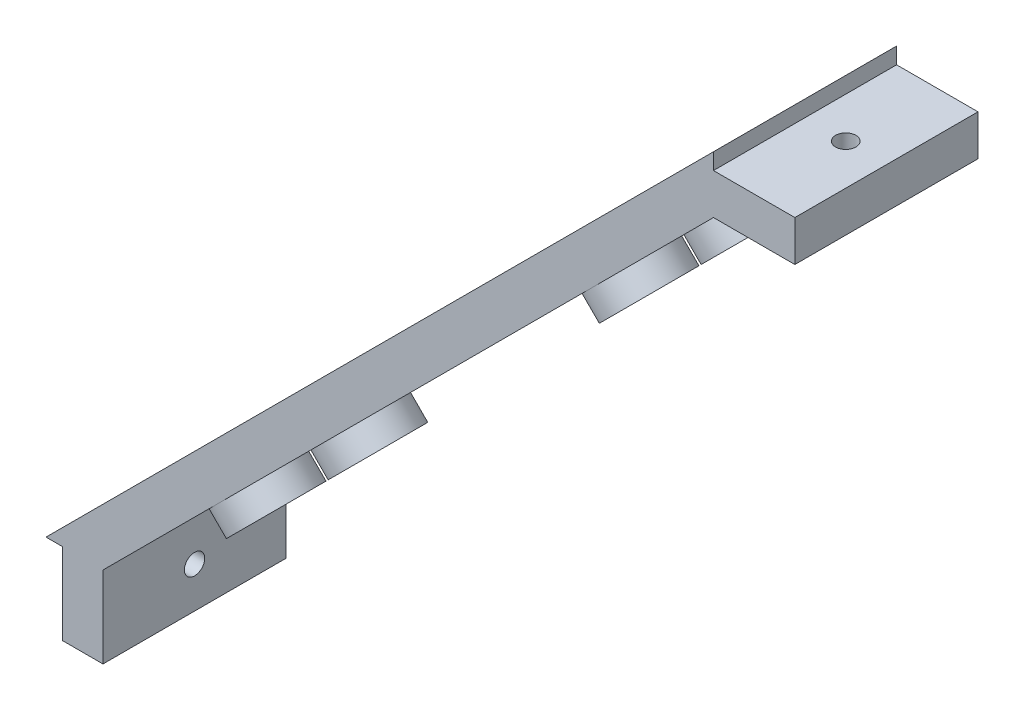
ISO-10303-21;
HEADER;
FILE_DESCRIPTION(('STEP AP214'),'2;1');
FILE_NAME('part.step','',(''),(''),'','','');
FILE_SCHEMA(('AUTOMOTIVE_DESIGN { 1 0 10303 214 1 1 1 1 }'));
ENDSEC;
DATA;
#1=APPLICATION_CONTEXT('core data for automotive mechanical design processes');
#2=APPLICATION_PROTOCOL_DEFINITION('international standard','automotive_design',2000,#1);
#3=PRODUCT_CONTEXT('',#1,'mechanical');
#4=PRODUCT('Part','Part','',(#3));
#5=PRODUCT_RELATED_PRODUCT_CATEGORY('part','',(#4));
#6=PRODUCT_DEFINITION_FORMATION('','',#4);
#7=PRODUCT_DEFINITION_CONTEXT('part definition',#1,'design');
#8=PRODUCT_DEFINITION('design','',#6,#7);
#9=PRODUCT_DEFINITION_SHAPE('','',#8);
#10=(LENGTH_UNIT() NAMED_UNIT(*) SI_UNIT(.MILLI.,.METRE.));
#11=(NAMED_UNIT(*) PLANE_ANGLE_UNIT() SI_UNIT($,.RADIAN.));
#12=(NAMED_UNIT(*) SI_UNIT($,.STERADIAN.) SOLID_ANGLE_UNIT());
#13=UNCERTAINTY_MEASURE_WITH_UNIT(LENGTH_MEASURE(1.E-05),#10,'distance_accuracy_value','');
#14=(GEOMETRIC_REPRESENTATION_CONTEXT(3) GLOBAL_UNCERTAINTY_ASSIGNED_CONTEXT((#13)) GLOBAL_UNIT_ASSIGNED_CONTEXT((#10,
#11,#12)) REPRESENTATION_CONTEXT('',''));
#15=CARTESIAN_POINT('',(0.,0.,0.));
#16=DIRECTION('',(0.,0.,1.));
#17=DIRECTION('',(1.,0.,0.));
#18=AXIS2_PLACEMENT_3D('',#15,#16,#17);
#19=CARTESIAN_POINT('',(-69.284271247462,12.715728752538,-6.25));
#20=DIRECTION('',(0.707106781186549,-0.707106781186546,0.));
#21=DIRECTION('',(0.707106781186546,0.707106781186549,0.));
#22=AXIS2_PLACEMENT_3D('',#19,#20,#21);
#23=CYLINDRICAL_SURFACE('',#22,1.25);
#24=CARTESIAN_POINT('',(-24.7842712474619,-31.7842712474619,-6.25));
#25=DIRECTION('',(-0.707106781186549,0.707106781186546,0.));
#26=DIRECTION('',(-0.707106781186546,-0.707106781186549,0.));
#27=AXIS2_PLACEMENT_3D('',#24,#25,#26);
#28=CIRCLE('',#27,1.25);
#29=CARTESIAN_POINT('',(-25.668154723945,-32.6681547239451,-6.25));
#30=VERTEX_POINT('',#29);
#31=EDGE_CURVE('E43',#30,#30,#28,.T.);
#32=ORIENTED_EDGE('',*,*,#31,.F.);
#33=EDGE_LOOP('',(#32));
#34=FACE_BOUND('',#33,.T.);
#35=CARTESIAN_POINT('',(-28.2842712474619,-28.2842712474619,-6.25));
#36=DIRECTION('',(0.707106781186549,-0.707106781186546,0.));
#37=DIRECTION('',(0.707106781186546,0.707106781186549,0.));
#38=AXIS2_PLACEMENT_3D('',#35,#36,#37);
#39=CIRCLE('',#38,1.25);
#40=CARTESIAN_POINT('',(-27.4003877709787,-27.4003877709788,-6.25));
#41=VERTEX_POINT('',#40);
#42=EDGE_CURVE('E11',#41,#41,#39,.F.);
#43=ORIENTED_EDGE('',*,*,#42,.T.);
#44=EDGE_LOOP('',(#43));
#45=FACE_BOUND('',#44,.T.);
#46=ADVANCED_FACE('F35',(#34,#45),#23,.F.);
#47=CARTESIAN_POINT('',(-55.1421356237311,26.857864376269,-6.25));
#48=DIRECTION('',(0.707106781186549,-0.707106781186546,0.));
#49=DIRECTION('',(0.707106781186546,0.707106781186549,0.));
#50=AXIS2_PLACEMENT_3D('',#47,#48,#49);
#51=CYLINDRICAL_SURFACE('',#50,1.25);
#52=CARTESIAN_POINT('',(-10.6421356237309,-17.6421356237309,-6.25));
#53=DIRECTION('',(-0.707106781186549,0.707106781186546,0.));
#54=DIRECTION('',(-0.707106781186546,-0.707106781186549,0.));
#55=AXIS2_PLACEMENT_3D('',#52,#53,#54);
#56=CIRCLE('',#55,1.25);
#57=CARTESIAN_POINT('',(-11.5260191002141,-18.5260191002141,-6.25));
#58=VERTEX_POINT('',#57);
#59=EDGE_CURVE('E171',#58,#58,#56,.T.);
#60=ORIENTED_EDGE('',*,*,#59,.F.);
#61=EDGE_LOOP('',(#60));
#62=FACE_BOUND('',#61,.T.);
#63=CARTESIAN_POINT('',(-14.1421356237309,-14.142135623731,-6.25));
#64=DIRECTION('',(0.707106781186549,-0.707106781186546,0.));
#65=DIRECTION('',(0.707106781186546,0.707106781186549,0.));
#66=AXIS2_PLACEMENT_3D('',#63,#64,#65);
#67=CIRCLE('',#66,1.25);
#68=CARTESIAN_POINT('',(-13.2582521472478,-13.2582521472478,-6.25));
#69=VERTEX_POINT('',#68);
#70=EDGE_CURVE('E174',#69,#69,#67,.F.);
#71=ORIENTED_EDGE('',*,*,#70,.T.);
#72=EDGE_LOOP('',(#71));
#73=FACE_BOUND('',#72,.T.);
#74=ADVANCED_FACE('F330',(#62,#73),#51,.F.);
#75=CARTESIAN_POINT('',(-41.0000000000001,41.,-6.25));
#76=DIRECTION('',(0.707106781186549,-0.707106781186546,0.));
#77=DIRECTION('',(0.707106781186546,0.707106781186549,0.));
#78=AXIS2_PLACEMENT_3D('',#75,#76,#77);
#79=CYLINDRICAL_SURFACE('',#78,1.25);
#80=CARTESIAN_POINT('',(3.49999999999999,-3.49999999999998,-6.25));
#81=DIRECTION('',(-0.707106781186549,0.707106781186546,0.));
#82=DIRECTION('',(-0.707106781186546,-0.707106781186549,0.));
#83=AXIS2_PLACEMENT_3D('',#80,#81,#82);
#84=CIRCLE('',#83,1.25);
#85=CARTESIAN_POINT('',(2.61611652351681,-4.38388347648317,-6.25));
#86=VERTEX_POINT('',#85);
#87=EDGE_CURVE('E148',#86,#86,#84,.T.);
#88=ORIENTED_EDGE('',*,*,#87,.F.);
#89=EDGE_LOOP('',(#88));
#90=FACE_BOUND('',#89,.T.);
#91=CARTESIAN_POINT('',(0.,0.,-6.25));
#92=DIRECTION('',(0.707106781186549,-0.707106781186546,0.));
#93=DIRECTION('',(0.707106781186546,0.707106781186549,0.));
#94=AXIS2_PLACEMENT_3D('',#91,#92,#93);
#95=CIRCLE('',#94,1.25);
#96=CARTESIAN_POINT('',(0.883883476483156,0.883883476483201,-6.25));
#97=VERTEX_POINT('',#96);
#98=EDGE_CURVE('E151',#97,#97,#95,.F.);
#99=ORIENTED_EDGE('',*,*,#98,.T.);
#100=EDGE_LOOP('',(#99));
#101=FACE_BOUND('',#100,.T.);
#102=ADVANCED_FACE('F335',(#90,#101),#79,.F.);
#103=CARTESIAN_POINT('',(-41.,-41.0000000000001,11.25));
#104=DIRECTION('',(0.,1.,0.));
#105=DIRECTION('',(0.,0.,1.));
#106=AXIS2_PLACEMENT_3D('',#103,#104,#105);
#107=PLANE('',#106);
#108=DIRECTION('',(1.,0.,0.));
#109=VECTOR('',#108,1.);
#110=CARTESIAN_POINT('',(-41.,-41.0000000000001,-11.25));
#111=LINE('',#110,#109);
#112=CARTESIAN_POINT('',(-41.,-41.0000000000001,-11.25));
#113=VERTEX_POINT('',#112);
#114=CARTESIAN_POINT('',(-39.,-41.0000000000001,-11.25));
#115=VERTEX_POINT('',#114);
#116=EDGE_CURVE('E147',#113,#115,#111,.T.);
#117=ORIENTED_EDGE('',*,*,#116,.T.);
#118=DIRECTION('',(0.,0.,-1.));
#119=VECTOR('',#118,1.);
#120=CARTESIAN_POINT('',(-39.,-41.0000000000001,11.25));
#121=LINE('',#120,#119);
#122=CARTESIAN_POINT('',(-39.,-41.0000000000001,11.25));
#123=VERTEX_POINT('',#122);
#124=EDGE_CURVE('E127',#123,#115,#121,.T.);
#125=ORIENTED_EDGE('',*,*,#124,.F.);
#126=DIRECTION('',(1.,0.,0.));
#127=VECTOR('',#126,1.);
#128=CARTESIAN_POINT('',(-41.,-41.0000000000001,11.25));
#129=LINE('',#128,#127);
#130=CARTESIAN_POINT('',(-41.,-41.0000000000001,11.25));
#131=VERTEX_POINT('',#130);
#132=EDGE_CURVE('E134',#131,#123,#129,.T.);
#133=ORIENTED_EDGE('',*,*,#132,.F.);
#134=DIRECTION('',(0.,0.,-1.));
#135=VECTOR('',#134,1.);
#136=CARTESIAN_POINT('',(-41.,-41.0000000000001,11.25));
#137=LINE('',#136,#135);
#138=EDGE_CURVE('E256',#131,#113,#137,.T.);
#139=ORIENTED_EDGE('',*,*,#138,.T.);
#140=EDGE_LOOP('',(#117,#125,#133,#139));
#141=FACE_BOUND('',#140,.T.);
#142=ADVANCED_FACE('F145',(#141),#107,.F.);
#143=CARTESIAN_POINT('',(-39.,-41.0000000000001,11.25));
#144=DIRECTION('',(1.,0.,0.));
#145=DIRECTION('',(0.,0.,-1.));
#146=AXIS2_PLACEMENT_3D('',#143,#144,#145);
#147=PLANE('',#146);
#148=CARTESIAN_POINT('',(-39.,-46.0000000000001,0.));
#149=DIRECTION('',(1.,0.,0.));
#150=DIRECTION('',(0.,0.,-1.));
#151=AXIS2_PLACEMENT_3D('',#148,#149,#150);
#152=CIRCLE('',#151,1.25);
#153=CARTESIAN_POINT('',(-39.,-46.0000000000001,-1.25));
#154=VERTEX_POINT('',#153);
#155=EDGE_CURVE('E160',#154,#154,#152,.T.);
#156=ORIENTED_EDGE('',*,*,#155,.T.);
#157=EDGE_LOOP('',(#156));
#158=FACE_BOUND('',#157,.T.);
#159=DIRECTION('',(0.,-1.,0.));
#160=VECTOR('',#159,1.);
#161=CARTESIAN_POINT('',(-39.,-41.0000000000001,-11.25));
#162=LINE('',#161,#160);
#163=CARTESIAN_POINT('',(-39.,-51.0000000000001,-11.25));
#164=VERTEX_POINT('',#163);
#165=EDGE_CURVE('E258',#115,#164,#162,.T.);
#166=ORIENTED_EDGE('',*,*,#165,.T.);
#167=DIRECTION('',(0.,0.,-1.));
#168=VECTOR('',#167,1.);
#169=CARTESIAN_POINT('',(-39.,-51.0000000000001,11.25));
#170=LINE('',#169,#168);
#171=CARTESIAN_POINT('',(-39.,-51.0000000000001,11.25));
#172=VERTEX_POINT('',#171);
#173=EDGE_CURVE('E130',#172,#164,#170,.T.);
#174=ORIENTED_EDGE('',*,*,#173,.F.);
#175=DIRECTION('',(0.,-1.,0.));
#176=VECTOR('',#175,1.);
#177=CARTESIAN_POINT('',(-39.,-41.0000000000001,11.25));
#178=LINE('',#177,#176);
#179=EDGE_CURVE('E123',#123,#172,#178,.T.);
#180=ORIENTED_EDGE('',*,*,#179,.F.);
#181=ORIENTED_EDGE('',*,*,#124,.T.);
#182=EDGE_LOOP('',(#166,#174,#180,#181));
#183=FACE_BOUND('',#182,.T.);
#184=ADVANCED_FACE('F125',(#158,#183),#147,.F.);
#185=CARTESIAN_POINT('',(-39.,-51.0000000000001,11.25));
#186=DIRECTION('',(0.,1.,0.));
#187=DIRECTION('',(0.,0.,1.));
#188=AXIS2_PLACEMENT_3D('',#185,#186,#187);
#189=PLANE('',#188);
#190=DIRECTION('',(1.,0.,0.));
#191=VECTOR('',#190,1.);
#192=CARTESIAN_POINT('',(-39.,-51.0000000000001,-11.25));
#193=LINE('',#192,#191);
#194=CARTESIAN_POINT('',(-34.,-51.0000000000001,-11.25));
#195=VERTEX_POINT('',#194);
#196=EDGE_CURVE('E260',#164,#195,#193,.T.);
#197=ORIENTED_EDGE('',*,*,#196,.T.);
#198=DIRECTION('',(0.,0.,-1.));
#199=VECTOR('',#198,1.);
#200=CARTESIAN_POINT('',(-34.,-51.0000000000001,11.25));
#201=LINE('',#200,#199);
#202=CARTESIAN_POINT('',(-34.,-51.0000000000001,11.25));
#203=VERTEX_POINT('',#202);
#204=EDGE_CURVE('E153',#203,#195,#201,.T.);
#205=ORIENTED_EDGE('',*,*,#204,.F.);
#206=DIRECTION('',(1.,0.,0.));
#207=VECTOR('',#206,1.);
#208=CARTESIAN_POINT('',(-39.,-51.0000000000001,11.25));
#209=LINE('',#208,#207);
#210=EDGE_CURVE('E133',#172,#203,#209,.T.);
#211=ORIENTED_EDGE('',*,*,#210,.F.);
#212=ORIENTED_EDGE('',*,*,#173,.T.);
#213=EDGE_LOOP('',(#197,#205,#211,#212));
#214=FACE_BOUND('',#213,.T.);
#215=ADVANCED_FACE('F318',(#214),#189,.F.);
#216=CARTESIAN_POINT('',(-34.,-51.0000000000001,11.25));
#217=DIRECTION('',(-1.,0.,0.));
#218=DIRECTION('',(0.,0.,1.));
#219=AXIS2_PLACEMENT_3D('',#216,#217,#218);
#220=PLANE('',#219);
#221=CARTESIAN_POINT('',(-34.,-46.0000000000001,0.));
#222=DIRECTION('',(-1.,0.,0.));
#223=DIRECTION('',(0.,0.,1.));
#224=AXIS2_PLACEMENT_3D('',#221,#222,#223);
#225=CIRCLE('',#224,1.25);
#226=CARTESIAN_POINT('',(-34.,-46.0000000000001,1.25));
#227=VERTEX_POINT('',#226);
#228=EDGE_CURVE('E157',#227,#227,#225,.T.);
#229=ORIENTED_EDGE('',*,*,#228,.T.);
#230=EDGE_LOOP('',(#229));
#231=FACE_BOUND('',#230,.T.);
#232=DIRECTION('',(0.,1.,0.));
#233=VECTOR('',#232,1.);
#234=CARTESIAN_POINT('',(-34.,-51.0000000000001,-11.25));
#235=LINE('',#234,#233);
#236=CARTESIAN_POINT('',(-34.,-41.0000000000001,-11.25));
#237=VERTEX_POINT('',#236);
#238=EDGE_CURVE('E262',#195,#237,#235,.T.);
#239=ORIENTED_EDGE('',*,*,#238,.T.);
#240=DIRECTION('',(0.,0.,-1.));
#241=VECTOR('',#240,1.);
#242=CARTESIAN_POINT('',(-34.,-41.0000000000001,11.25));
#243=LINE('',#242,#241);
#244=CARTESIAN_POINT('',(-34.,-41.0000000000001,11.25));
#245=VERTEX_POINT('',#244);
#246=EDGE_CURVE('E294',#245,#237,#243,.T.);
#247=ORIENTED_EDGE('',*,*,#246,.F.);
#248=DIRECTION('',(0.,1.,0.));
#249=VECTOR('',#248,1.);
#250=CARTESIAN_POINT('',(-34.,-51.0000000000001,11.25));
#251=LINE('',#250,#249);
#252=EDGE_CURVE('E240',#203,#245,#251,.T.);
#253=ORIENTED_EDGE('',*,*,#252,.F.);
#254=ORIENTED_EDGE('',*,*,#204,.T.);
#255=EDGE_LOOP('',(#239,#247,#253,#254));
#256=FACE_BOUND('',#255,.T.);
#257=ADVANCED_FACE('F301',(#231,#256),#220,.F.);
#258=CARTESIAN_POINT('',(-34.,-41.0000000000001,11.25));
#259=DIRECTION('',(-0.707106781186549,0.707106781186546,0.));
#260=DIRECTION('',(-0.707106781186546,-0.707106781186549,0.));
#261=AXIS2_PLACEMENT_3D('',#258,#259,#260);
#262=PLANE('',#261);
#263=CARTESIAN_POINT('',(-10.6421356237309,-17.6421356237309,6.25));
#264=DIRECTION('',(-0.707106781186549,0.707106781186546,0.));
#265=DIRECTION('',(-0.707106781186546,-0.707106781186549,0.));
#266=AXIS2_PLACEMENT_3D('',#263,#264,#265);
#267=CIRCLE('',#266,1.25);
#268=CARTESIAN_POINT('',(-11.5260191002141,-18.5260191002141,6.25));
#269=VERTEX_POINT('',#268);
#270=EDGE_CURVE('E376',#269,#269,#267,.T.);
#271=ORIENTED_EDGE('',*,*,#270,.T.);
#272=EDGE_LOOP('',(#271));
#273=FACE_BOUND('',#272,.T.);
#274=CARTESIAN_POINT('',(-24.7842712474619,-31.7842712474619,6.25));
#275=DIRECTION('',(-0.707106781186549,0.707106781186546,0.));
#276=DIRECTION('',(-0.707106781186546,-0.707106781186549,0.));
#277=AXIS2_PLACEMENT_3D('',#274,#275,#276);
#278=CIRCLE('',#277,1.25);
#279=CARTESIAN_POINT('',(-25.668154723945,-32.6681547239451,6.25));
#280=VERTEX_POINT('',#279);
#281=EDGE_CURVE('E380',#280,#280,#278,.T.);
#282=ORIENTED_EDGE('',*,*,#281,.T.);
#283=EDGE_LOOP('',(#282));
#284=FACE_BOUND('',#283,.T.);
#285=CARTESIAN_POINT('',(17.6421356237309,10.642135623731,6.25));
#286=DIRECTION('',(-0.707106781186549,0.707106781186546,0.));
#287=DIRECTION('',(-0.707106781186546,-0.707106781186549,0.));
#288=AXIS2_PLACEMENT_3D('',#285,#286,#287);
#289=CIRCLE('',#288,1.25);
#290=CARTESIAN_POINT('',(16.7582521472477,9.75825214724781,6.25));
#291=VERTEX_POINT('',#290);
#292=EDGE_CURVE('E188',#291,#291,#289,.T.);
#293=ORIENTED_EDGE('',*,*,#292,.T.);
#294=EDGE_LOOP('',(#293));
#295=FACE_BOUND('',#294,.T.);
#296=CARTESIAN_POINT('',(3.49999999999999,-3.49999999999998,6.25));
#297=DIRECTION('',(-0.707106781186549,0.707106781186546,0.));
#298=DIRECTION('',(-0.707106781186546,-0.707106781186549,0.));
#299=AXIS2_PLACEMENT_3D('',#296,#297,#298);
#300=CIRCLE('',#299,1.25);
#301=CARTESIAN_POINT('',(2.61611652351681,-4.38388347648317,6.25));
#302=VERTEX_POINT('',#301);
#303=EDGE_CURVE('E386',#302,#302,#300,.T.);
#304=ORIENTED_EDGE('',*,*,#303,.T.);
#305=EDGE_LOOP('',(#304));
#306=FACE_BOUND('',#305,.T.);
#307=CARTESIAN_POINT('',(31.7842712474618,24.784271247462,6.25));
#308=DIRECTION('',(-0.707106781186549,0.707106781186546,0.));
#309=DIRECTION('',(-0.707106781186546,-0.707106781186549,0.));
#310=AXIS2_PLACEMENT_3D('',#307,#308,#309);
#311=CIRCLE('',#310,1.25);
#312=CARTESIAN_POINT('',(30.9003877709787,23.9003877709788,6.25));
#313=VERTEX_POINT('',#312);
#314=EDGE_CURVE('E183',#313,#313,#311,.T.);
#315=ORIENTED_EDGE('',*,*,#314,.T.);
#316=EDGE_LOOP('',(#315));
#317=FACE_BOUND('',#316,.T.);
#318=CARTESIAN_POINT('',(17.6421356237309,10.642135623731,-6.25));
#319=DIRECTION('',(-0.707106781186549,0.707106781186546,0.));
#320=DIRECTION('',(-0.707106781186546,-0.707106781186549,0.));
#321=AXIS2_PLACEMENT_3D('',#318,#319,#320);
#322=CIRCLE('',#321,1.25);
#323=CARTESIAN_POINT('',(16.7582521472477,9.75825214724781,-6.25));
#324=VERTEX_POINT('',#323);
#325=EDGE_CURVE('E225',#324,#324,#322,.T.);
#326=ORIENTED_EDGE('',*,*,#325,.T.);
#327=EDGE_LOOP('',(#326));
#328=FACE_BOUND('',#327,.T.);
#329=CARTESIAN_POINT('',(31.7842712474618,24.784271247462,-6.25));
#330=DIRECTION('',(-0.707106781186549,0.707106781186546,0.));
#331=DIRECTION('',(-0.707106781186546,-0.707106781186549,0.));
#332=AXIS2_PLACEMENT_3D('',#329,#330,#331);
#333=CIRCLE('',#332,1.25);
#334=CARTESIAN_POINT('',(30.9003877709787,23.9003877709788,-6.25));
#335=VERTEX_POINT('',#334);
#336=EDGE_CURVE('E167',#335,#335,#333,.T.);
#337=ORIENTED_EDGE('',*,*,#336,.T.);
#338=EDGE_LOOP('',(#337));
#339=FACE_BOUND('',#338,.T.);
#340=DIRECTION('',(0.707106781186546,0.707106781186549,0.));
#341=VECTOR('',#340,1.);
#342=CARTESIAN_POINT('',(-34.,-41.0000000000001,11.25));
#343=LINE('',#342,#341);
#344=CARTESIAN_POINT('',(25.9799633006818,18.9799633006819,11.25));
#345=VERTEX_POINT('',#344);
#346=CARTESIAN_POINT('',(41.,34.0000000000001,11.25));
#347=VERTEX_POINT('',#346);
#348=EDGE_CURVE('E242',#345,#347,#343,.T.);
#349=ORIENTED_EDGE('',*,*,#348,.F.);
#350=CARTESIAN_POINT('',(25.9799633006817,18.9799633006818,6.25));
#351=DIRECTION('',(-0.707106781186549,0.707106781186546,0.));
#352=DIRECTION('',(-0.707106781186546,-0.707106781186549,0.));
#353=AXIS2_PLACEMENT_3D('',#350,#351,#352);
#354=CIRCLE('',#353,5.);
#355=EDGE_CURVE('E49',#345,#345,#354,.T.);
#356=ORIENTED_EDGE('',*,*,#355,.T.);
#357=CARTESIAN_POINT('',(-19.8405561202065,-26.8405561202065,11.25));
#358=VERTEX_POINT('',#357);
#359=EDGE_CURVE('E247',#358,#345,#343,.T.);
#360=ORIENTED_EDGE('',*,*,#359,.F.);
#361=CARTESIAN_POINT('',(-19.8405561202065,-26.8405561202065,6.25));
#362=DIRECTION('',(-0.707106781186549,0.707106781186546,0.));
#363=DIRECTION('',(-0.707106781186546,-0.707106781186549,0.));
#364=AXIS2_PLACEMENT_3D('',#361,#362,#363);
#365=CIRCLE('',#364,5.);
#366=EDGE_CURVE('E54',#358,#358,#365,.T.);
#367=ORIENTED_EDGE('',*,*,#366,.T.);
#368=EDGE_CURVE('E243',#245,#358,#343,.T.);
#369=ORIENTED_EDGE('',*,*,#368,.F.);
#370=ORIENTED_EDGE('',*,*,#246,.T.);
#371=DIRECTION('',(0.707106781186546,0.707106781186549,0.));
#372=VECTOR('',#371,1.);
#373=CARTESIAN_POINT('',(-34.,-41.0000000000001,-11.25));
#374=LINE('',#373,#372);
#375=CARTESIAN_POINT('',(-19.8405561202065,-26.8405561202065,-11.25));
#376=VERTEX_POINT('',#375);
#377=EDGE_CURVE('E265',#237,#376,#374,.T.);
#378=ORIENTED_EDGE('',*,*,#377,.T.);
#379=CARTESIAN_POINT('',(-19.8405561202065,-26.8405561202065,-6.25));
#380=DIRECTION('',(-0.707106781186549,0.707106781186546,0.));
#381=DIRECTION('',(-0.707106781186546,-0.707106781186549,0.));
#382=AXIS2_PLACEMENT_3D('',#379,#380,#381);
#383=CIRCLE('',#382,5.);
#384=EDGE_CURVE('E219',#376,#376,#383,.T.);
#385=ORIENTED_EDGE('',*,*,#384,.T.);
#386=CARTESIAN_POINT('',(25.9799633006818,18.9799633006819,-11.25));
#387=VERTEX_POINT('',#386);
#388=EDGE_CURVE('E269',#376,#387,#374,.T.);
#389=ORIENTED_EDGE('',*,*,#388,.T.);
#390=CARTESIAN_POINT('',(25.9799633006817,18.9799633006818,-6.25));
#391=DIRECTION('',(-0.707106781186549,0.707106781186546,0.));
#392=DIRECTION('',(-0.707106781186546,-0.707106781186549,0.));
#393=AXIS2_PLACEMENT_3D('',#390,#391,#392);
#394=CIRCLE('',#393,5.);
#395=EDGE_CURVE('E215',#387,#387,#394,.T.);
#396=ORIENTED_EDGE('',*,*,#395,.T.);
#397=CARTESIAN_POINT('',(41.,34.0000000000001,-11.25));
#398=VERTEX_POINT('',#397);
#399=EDGE_CURVE('E264',#387,#398,#374,.T.);
#400=ORIENTED_EDGE('',*,*,#399,.T.);
#401=DIRECTION('',(0.,0.,-1.));
#402=VECTOR('',#401,1.);
#403=CARTESIAN_POINT('',(41.,34.0000000000001,11.25));
#404=LINE('',#403,#402);
#405=EDGE_CURVE('E291',#347,#398,#404,.T.);
#406=ORIENTED_EDGE('',*,*,#405,.F.);
#407=EDGE_LOOP('',(#349,#356,#360,#367,#369,#370,#378,#385,#389,#396,#400,#406));
#408=FACE_BOUND('',#407,.T.);
#409=ORIENTED_EDGE('',*,*,#87,.T.);
#410=EDGE_LOOP('',(#409));
#411=FACE_BOUND('',#410,.T.);
#412=ORIENTED_EDGE('',*,*,#59,.T.);
#413=EDGE_LOOP('',(#412));
#414=FACE_BOUND('',#413,.T.);
#415=ORIENTED_EDGE('',*,*,#31,.T.);
#416=EDGE_LOOP('',(#415));
#417=FACE_BOUND('',#416,.T.);
#418=ADVANCED_FACE('F313',(#273,#284,#295,#306,#317,#328,#339,#408,#411,#414,#417),#262,.F.);
#419=CARTESIAN_POINT('',(41.,34.0000000000001,11.25));
#420=DIRECTION('',(0.,1.,0.));
#421=DIRECTION('',(0.,0.,1.));
#422=AXIS2_PLACEMENT_3D('',#419,#420,#421);
#423=PLANE('',#422);
#424=CARTESIAN_POINT('',(46.,34.0000000000001,0.));
#425=DIRECTION('',(0.,1.,0.));
#426=DIRECTION('',(0.,0.,1.));
#427=AXIS2_PLACEMENT_3D('',#424,#425,#426);
#428=CIRCLE('',#427,1.24999999999999);
#429=CARTESIAN_POINT('',(46.,34.0000000000001,1.24999999999999));
#430=VERTEX_POINT('',#429);
#431=EDGE_CURVE('E161',#430,#430,#428,.T.);
#432=ORIENTED_EDGE('',*,*,#431,.T.);
#433=EDGE_LOOP('',(#432));
#434=FACE_BOUND('',#433,.T.);
#435=DIRECTION('',(1.,0.,0.));
#436=VECTOR('',#435,1.);
#437=CARTESIAN_POINT('',(41.,34.0000000000001,-11.25));
#438=LINE('',#437,#436);
#439=CARTESIAN_POINT('',(51.,34.0000000000001,-11.25));
#440=VERTEX_POINT('',#439);
#441=EDGE_CURVE('E268',#398,#440,#438,.T.);
#442=ORIENTED_EDGE('',*,*,#441,.T.);
#443=DIRECTION('',(0.,0.,-1.));
#444=VECTOR('',#443,1.);
#445=CARTESIAN_POINT('',(51.,34.0000000000001,11.25));
#446=LINE('',#445,#444);
#447=CARTESIAN_POINT('',(51.,34.0000000000001,11.25));
#448=VERTEX_POINT('',#447);
#449=EDGE_CURVE('E288',#448,#440,#446,.T.);
#450=ORIENTED_EDGE('',*,*,#449,.F.);
#451=DIRECTION('',(1.,0.,0.));
#452=VECTOR('',#451,1.);
#453=CARTESIAN_POINT('',(41.,34.0000000000001,11.25));
#454=LINE('',#453,#452);
#455=EDGE_CURVE('E246',#347,#448,#454,.T.);
#456=ORIENTED_EDGE('',*,*,#455,.F.);
#457=ORIENTED_EDGE('',*,*,#405,.T.);
#458=EDGE_LOOP('',(#442,#450,#456,#457));
#459=FACE_BOUND('',#458,.T.);
#460=ADVANCED_FACE('F364',(#434,#459),#423,.F.);
#461=CARTESIAN_POINT('',(51.,39.0000000000001,11.25));
#462=DIRECTION('',(-1.,0.,0.));
#463=DIRECTION('',(0.,0.,1.));
#464=AXIS2_PLACEMENT_3D('',#461,#462,#463);
#465=PLANE('',#464);
#466=DIRECTION('',(0.,1.,0.));
#467=VECTOR('',#466,1.);
#468=CARTESIAN_POINT('',(51.,39.0000000000001,-11.25));
#469=LINE('',#468,#467);
#470=CARTESIAN_POINT('',(51.,39.0000000000001,-11.25));
#471=VERTEX_POINT('',#470);
#472=EDGE_CURVE('E271',#440,#471,#469,.T.);
#473=ORIENTED_EDGE('',*,*,#472,.T.);
#474=DIRECTION('',(0.,0.,-1.));
#475=VECTOR('',#474,1.);
#476=CARTESIAN_POINT('',(51.,39.0000000000001,11.25));
#477=LINE('',#476,#475);
#478=CARTESIAN_POINT('',(51.,39.0000000000001,11.25));
#479=VERTEX_POINT('',#478);
#480=EDGE_CURVE('E285',#479,#471,#477,.T.);
#481=ORIENTED_EDGE('',*,*,#480,.F.);
#482=DIRECTION('',(0.,1.,0.));
#483=VECTOR('',#482,1.);
#484=CARTESIAN_POINT('',(51.,39.0000000000001,11.25));
#485=LINE('',#484,#483);
#486=EDGE_CURVE('E249',#448,#479,#485,.T.);
#487=ORIENTED_EDGE('',*,*,#486,.F.);
#488=ORIENTED_EDGE('',*,*,#449,.T.);
#489=EDGE_LOOP('',(#473,#481,#487,#488));
#490=FACE_BOUND('',#489,.T.);
#491=ADVANCED_FACE('F360',(#490),#465,.F.);
#492=CARTESIAN_POINT('',(41.,39.0000000000001,11.25));
#493=DIRECTION('',(0.,-1.,0.));
#494=DIRECTION('',(0.,0.,-1.));
#495=AXIS2_PLACEMENT_3D('',#492,#493,#494);
#496=PLANE('',#495);
#497=CARTESIAN_POINT('',(46.,39.0000000000001,0.));
#498=DIRECTION('',(0.,-1.,0.));
#499=DIRECTION('',(0.,0.,-1.));
#500=AXIS2_PLACEMENT_3D('',#497,#498,#499);
#501=CIRCLE('',#500,1.24999999999999);
#502=CARTESIAN_POINT('',(46.,39.0000000000001,-1.24999999999999));
#503=VERTEX_POINT('',#502);
#504=EDGE_CURVE('E162',#503,#503,#501,.T.);
#505=ORIENTED_EDGE('',*,*,#504,.T.);
#506=EDGE_LOOP('',(#505));
#507=FACE_BOUND('',#506,.T.);
#508=DIRECTION('',(-1.,0.,0.));
#509=VECTOR('',#508,1.);
#510=CARTESIAN_POINT('',(41.,39.0000000000001,-11.25));
#511=LINE('',#510,#509);
#512=CARTESIAN_POINT('',(41.,39.0000000000001,-11.25));
#513=VERTEX_POINT('',#512);
#514=EDGE_CURVE('E273',#471,#513,#511,.T.);
#515=ORIENTED_EDGE('',*,*,#514,.T.);
#516=DIRECTION('',(0.,0.,-1.));
#517=VECTOR('',#516,1.);
#518=CARTESIAN_POINT('',(41.,39.0000000000001,11.25));
#519=LINE('',#518,#517);
#520=CARTESIAN_POINT('',(41.,39.0000000000001,11.25));
#521=VERTEX_POINT('',#520);
#522=EDGE_CURVE('E282',#521,#513,#519,.T.);
#523=ORIENTED_EDGE('',*,*,#522,.F.);
#524=DIRECTION('',(-1.,0.,0.));
#525=VECTOR('',#524,1.);
#526=CARTESIAN_POINT('',(41.,39.0000000000001,11.25));
#527=LINE('',#526,#525);
#528=EDGE_CURVE('E251',#479,#521,#527,.T.);
#529=ORIENTED_EDGE('',*,*,#528,.F.);
#530=ORIENTED_EDGE('',*,*,#480,.T.);
#531=EDGE_LOOP('',(#515,#523,#529,#530));
#532=FACE_BOUND('',#531,.T.);
#533=ADVANCED_FACE('F351',(#507,#532),#496,.F.);
#534=CARTESIAN_POINT('',(41.,41.0000000000001,11.25));
#535=DIRECTION('',(-1.,0.,0.));
#536=DIRECTION('',(0.,-1.,0.));
#537=AXIS2_PLACEMENT_3D('',#534,#535,#536);
#538=PLANE('',#537);
#539=DIRECTION('',(0.,1.,0.));
#540=VECTOR('',#539,1.);
#541=CARTESIAN_POINT('',(41.,41.0000000000001,-11.25));
#542=LINE('',#541,#540);
#543=CARTESIAN_POINT('',(41.,41.0000000000001,-11.25));
#544=VERTEX_POINT('',#543);
#545=EDGE_CURVE('E275',#513,#544,#542,.T.);
#546=ORIENTED_EDGE('',*,*,#545,.T.);
#547=DIRECTION('',(0.,0.,-1.));
#548=VECTOR('',#547,1.);
#549=CARTESIAN_POINT('',(41.,41.0000000000001,11.25));
#550=LINE('',#549,#548);
#551=CARTESIAN_POINT('',(41.,41.0000000000001,11.25));
#552=VERTEX_POINT('',#551);
#553=EDGE_CURVE('E279',#552,#544,#550,.T.);
#554=ORIENTED_EDGE('',*,*,#553,.F.);
#555=DIRECTION('',(0.,1.,0.));
#556=VECTOR('',#555,1.);
#557=CARTESIAN_POINT('',(41.,41.0000000000001,11.25));
#558=LINE('',#557,#556);
#559=EDGE_CURVE('E253',#521,#552,#558,.T.);
#560=ORIENTED_EDGE('',*,*,#559,.F.);
#561=ORIENTED_EDGE('',*,*,#522,.T.);
#562=EDGE_LOOP('',(#546,#554,#560,#561));
#563=FACE_BOUND('',#562,.T.);
#564=ADVANCED_FACE('F343',(#563),#538,.F.);
#565=CARTESIAN_POINT('',(-41.,-41.0000000000001,11.25));
#566=DIRECTION('',(0.707106781186549,-0.707106781186546,0.));
#567=DIRECTION('',(0.707106781186546,0.707106781186549,0.));
#568=AXIS2_PLACEMENT_3D('',#565,#566,#567);
#569=PLANE('',#568);
#570=CARTESIAN_POINT('',(-23.3405561202065,-23.3405561202065,6.25));
#571=DIRECTION('',(0.707106781186549,-0.707106781186546,0.));
#572=DIRECTION('',(0.707106781186546,0.707106781186549,0.));
#573=AXIS2_PLACEMENT_3D('',#570,#571,#572);
#574=CIRCLE('',#573,1.25);
#575=CARTESIAN_POINT('',(-22.4566726437233,-22.4566726437233,6.25));
#576=VERTEX_POINT('',#575);
#577=EDGE_CURVE('E697',#576,#576,#574,.T.);
#578=ORIENTED_EDGE('',*,*,#577,.T.);
#579=EDGE_LOOP('',(#578));
#580=FACE_BOUND('',#579,.T.);
#581=CARTESIAN_POINT('',(22.4799633006817,22.4799633006819,6.25));
#582=DIRECTION('',(0.707106781186549,-0.707106781186546,0.));
#583=DIRECTION('',(0.707106781186546,0.707106781186549,0.));
#584=AXIS2_PLACEMENT_3D('',#581,#582,#583);
#585=CIRCLE('',#584,1.25);
#586=CARTESIAN_POINT('',(23.3638467771649,23.363846777165,6.25));
#587=VERTEX_POINT('',#586);
#588=EDGE_CURVE('E701',#587,#587,#585,.T.);
#589=ORIENTED_EDGE('',*,*,#588,.T.);
#590=EDGE_LOOP('',(#589));
#591=FACE_BOUND('',#590,.T.);
#592=CARTESIAN_POINT('',(-14.1421356237309,-14.142135623731,6.25));
#593=DIRECTION('',(0.707106781186549,-0.707106781186546,0.));
#594=DIRECTION('',(0.707106781186546,0.707106781186549,0.));
#595=AXIS2_PLACEMENT_3D('',#592,#593,#594);
#596=CIRCLE('',#595,1.25);
#597=CARTESIAN_POINT('',(-13.2582521472478,-13.2582521472478,6.25));
#598=VERTEX_POINT('',#597);
#599=EDGE_CURVE('E38',#598,#598,#596,.F.);
#600=ORIENTED_EDGE('',*,*,#599,.F.);
#601=EDGE_LOOP('',(#600));
#602=FACE_BOUND('',#601,.T.);
#603=CARTESIAN_POINT('',(-28.2842712474619,-28.2842712474619,6.25));
#604=DIRECTION('',(0.707106781186549,-0.707106781186546,0.));
#605=DIRECTION('',(0.707106781186546,0.707106781186549,0.));
#606=AXIS2_PLACEMENT_3D('',#603,#604,#605);
#607=CIRCLE('',#606,1.25);
#608=CARTESIAN_POINT('',(-27.4003877709787,-27.4003877709788,6.25));
#609=VERTEX_POINT('',#608);
#610=EDGE_CURVE('E190',#609,#609,#607,.F.);
#611=ORIENTED_EDGE('',*,*,#610,.F.);
#612=EDGE_LOOP('',(#611));
#613=FACE_BOUND('',#612,.T.);
#614=CARTESIAN_POINT('',(14.1421356237309,14.142135623731,6.25));
#615=DIRECTION('',(0.707106781186549,-0.707106781186546,0.));
#616=DIRECTION('',(0.707106781186546,0.707106781186549,0.));
#617=AXIS2_PLACEMENT_3D('',#614,#615,#616);
#618=CIRCLE('',#617,1.25);
#619=CARTESIAN_POINT('',(15.0260191002141,15.0260191002142,6.25));
#620=VERTEX_POINT('',#619);
#621=EDGE_CURVE('E187',#620,#620,#618,.F.);
#622=ORIENTED_EDGE('',*,*,#621,.F.);
#623=EDGE_LOOP('',(#622));
#624=FACE_BOUND('',#623,.T.);
#625=CARTESIAN_POINT('',(0.,0.,6.25));
#626=DIRECTION('',(0.707106781186549,-0.707106781186546,0.));
#627=DIRECTION('',(0.707106781186546,0.707106781186549,0.));
#628=AXIS2_PLACEMENT_3D('',#625,#626,#627);
#629=CIRCLE('',#628,1.25);
#630=CARTESIAN_POINT('',(0.88388347648317,0.883883476483201,6.25));
#631=VERTEX_POINT('',#630);
#632=EDGE_CURVE('E184',#631,#631,#629,.F.);
#633=ORIENTED_EDGE('',*,*,#632,.F.);
#634=EDGE_LOOP('',(#633));
#635=FACE_BOUND('',#634,.T.);
#636=CARTESIAN_POINT('',(28.2842712474618,28.284271247462,6.25));
#637=DIRECTION('',(0.707106781186549,-0.707106781186546,0.));
#638=DIRECTION('',(0.707106781186546,0.707106781186549,0.));
#639=AXIS2_PLACEMENT_3D('',#636,#637,#638);
#640=CIRCLE('',#639,1.25);
#641=CARTESIAN_POINT('',(29.168154723945,29.1681547239452,6.25));
#642=VERTEX_POINT('',#641);
#643=EDGE_CURVE('E179',#642,#642,#640,.F.);
#644=ORIENTED_EDGE('',*,*,#643,.F.);
#645=EDGE_LOOP('',(#644));
#646=FACE_BOUND('',#645,.T.);
#647=CARTESIAN_POINT('',(-23.3405561202065,-23.3405561202065,-6.25));
#648=DIRECTION('',(0.707106781186549,-0.707106781186546,0.));
#649=DIRECTION('',(0.707106781186546,0.707106781186549,0.));
#650=AXIS2_PLACEMENT_3D('',#647,#648,#649);
#651=CIRCLE('',#650,1.25);
#652=CARTESIAN_POINT('',(-22.4566726437233,-22.4566726437233,-6.25));
#653=VERTEX_POINT('',#652);
#654=EDGE_CURVE('E206',#653,#653,#651,.T.);
#655=ORIENTED_EDGE('',*,*,#654,.T.);
#656=EDGE_LOOP('',(#655));
#657=FACE_BOUND('',#656,.T.);
#658=CARTESIAN_POINT('',(22.4799633006817,22.4799633006819,-6.25));
#659=DIRECTION('',(0.707106781186549,-0.707106781186546,0.));
#660=DIRECTION('',(0.707106781186546,0.707106781186549,0.));
#661=AXIS2_PLACEMENT_3D('',#658,#659,#660);
#662=CIRCLE('',#661,1.25);
#663=CARTESIAN_POINT('',(23.3638467771649,23.363846777165,-6.25));
#664=VERTEX_POINT('',#663);
#665=EDGE_CURVE('E212',#664,#664,#662,.T.);
#666=ORIENTED_EDGE('',*,*,#665,.T.);
#667=EDGE_LOOP('',(#666));
#668=FACE_BOUND('',#667,.T.);
#669=CARTESIAN_POINT('',(14.1421356237309,14.142135623731,-6.25));
#670=DIRECTION('',(0.707106781186549,-0.707106781186546,0.));
#671=DIRECTION('',(0.707106781186546,0.707106781186549,0.));
#672=AXIS2_PLACEMENT_3D('',#669,#670,#671);
#673=CIRCLE('',#672,1.25);
#674=CARTESIAN_POINT('',(15.0260191002141,15.0260191002142,-6.25));
#675=VERTEX_POINT('',#674);
#676=EDGE_CURVE('E230',#675,#675,#673,.F.);
#677=ORIENTED_EDGE('',*,*,#676,.F.);
#678=EDGE_LOOP('',(#677));
#679=FACE_BOUND('',#678,.T.);
#680=CARTESIAN_POINT('',(28.2842712474618,28.284271247462,-6.25));
#681=DIRECTION('',(0.707106781186549,-0.707106781186546,0.));
#682=DIRECTION('',(0.707106781186546,0.707106781186549,0.));
#683=AXIS2_PLACEMENT_3D('',#680,#681,#682);
#684=CIRCLE('',#683,1.25);
#685=CARTESIAN_POINT('',(29.168154723945,29.1681547239452,-6.25));
#686=VERTEX_POINT('',#685);
#687=EDGE_CURVE('E165',#686,#686,#684,.F.);
#688=ORIENTED_EDGE('',*,*,#687,.F.);
#689=EDGE_LOOP('',(#688));
#690=FACE_BOUND('',#689,.T.);
#691=DIRECTION('',(-0.707106781186546,-0.707106781186549,0.));
#692=VECTOR('',#691,1.);
#693=CARTESIAN_POINT('',(-41.,-41.0000000000001,-11.25));
#694=LINE('',#693,#692);
#695=EDGE_CURVE('E143',#544,#113,#694,.T.);
#696=ORIENTED_EDGE('',*,*,#695,.T.);
#697=ORIENTED_EDGE('',*,*,#138,.F.);
#698=DIRECTION('',(-0.707106781186546,-0.707106781186549,0.));
#699=VECTOR('',#698,1.);
#700=CARTESIAN_POINT('',(-41.,-41.0000000000001,11.25));
#701=LINE('',#700,#699);
#702=EDGE_CURVE('E139',#552,#131,#701,.T.);
#703=ORIENTED_EDGE('',*,*,#702,.F.);
#704=ORIENTED_EDGE('',*,*,#553,.T.);
#705=EDGE_LOOP('',(#696,#697,#703,#704));
#706=FACE_BOUND('',#705,.T.);
#707=ORIENTED_EDGE('',*,*,#98,.F.);
#708=EDGE_LOOP('',(#707));
#709=FACE_BOUND('',#708,.T.);
#710=ORIENTED_EDGE('',*,*,#70,.F.);
#711=EDGE_LOOP('',(#710));
#712=FACE_BOUND('',#711,.T.);
#713=ORIENTED_EDGE('',*,*,#42,.F.);
#714=EDGE_LOOP('',(#713));
#715=FACE_BOUND('',#714,.T.);
#716=ADVANCED_FACE('F341',(#580,#591,#602,#613,#624,#635,#646,#657,#668,#679,#690,#706,#709,
#712,#715),#569,.F.);
#717=CARTESIAN_POINT('',(0.,0.,11.25));
#718=DIRECTION('',(0.,0.,-1.));
#719=DIRECTION('',(-1.,0.,0.));
#720=AXIS2_PLACEMENT_3D('',#717,#718,#719);
#721=PLANE('',#720);
#722=ORIENTED_EDGE('',*,*,#132,.T.);
#723=ORIENTED_EDGE('',*,*,#179,.T.);
#724=ORIENTED_EDGE('',*,*,#210,.T.);
#725=ORIENTED_EDGE('',*,*,#252,.T.);
#726=ORIENTED_EDGE('',*,*,#368,.T.);
#727=ORIENTED_EDGE('',*,*,#359,.T.);
#728=ORIENTED_EDGE('',*,*,#348,.T.);
#729=ORIENTED_EDGE('',*,*,#455,.T.);
#730=ORIENTED_EDGE('',*,*,#486,.T.);
#731=ORIENTED_EDGE('',*,*,#528,.T.);
#732=ORIENTED_EDGE('',*,*,#559,.T.);
#733=ORIENTED_EDGE('',*,*,#702,.T.);
#734=EDGE_LOOP('',(#722,#723,#724,#725,#726,#727,#728,#729,#730,#731,#732,#733));
#735=FACE_BOUND('',#734,.T.);
#736=ADVANCED_FACE('F137',(#735),#721,.F.);
#737=CARTESIAN_POINT('',(0.,0.,-11.25));
#738=DIRECTION('',(0.,0.,-1.));
#739=DIRECTION('',(-1.,0.,0.));
#740=AXIS2_PLACEMENT_3D('',#737,#738,#739);
#741=PLANE('',#740);
#742=ORIENTED_EDGE('',*,*,#116,.F.);
#743=ORIENTED_EDGE('',*,*,#695,.F.);
#744=ORIENTED_EDGE('',*,*,#545,.F.);
#745=ORIENTED_EDGE('',*,*,#514,.F.);
#746=ORIENTED_EDGE('',*,*,#472,.F.);
#747=ORIENTED_EDGE('',*,*,#441,.F.);
#748=ORIENTED_EDGE('',*,*,#399,.F.);
#749=ORIENTED_EDGE('',*,*,#388,.F.);
#750=ORIENTED_EDGE('',*,*,#377,.F.);
#751=ORIENTED_EDGE('',*,*,#238,.F.);
#752=ORIENTED_EDGE('',*,*,#196,.F.);
#753=ORIENTED_EDGE('',*,*,#165,.F.);
#754=EDGE_LOOP('',(#742,#743,#744,#745,#746,#747,#748,#749,#750,#751,#752,#753));
#755=FACE_BOUND('',#754,.T.);
#756=ADVANCED_FACE('F307',(#755),#741,.T.);
#757=CARTESIAN_POINT('',(-41.,-46.0000000000001,0.));
#758=DIRECTION('',(1.,0.,0.));
#759=DIRECTION('',(0.,1.,0.));
#760=AXIS2_PLACEMENT_3D('',#757,#758,#759);
#761=CYLINDRICAL_SURFACE('',#760,1.25);
#762=ORIENTED_EDGE('',*,*,#228,.F.);
#763=EDGE_LOOP('',(#762));
#764=FACE_BOUND('',#763,.T.);
#765=ORIENTED_EDGE('',*,*,#155,.F.);
#766=EDGE_LOOP('',(#765));
#767=FACE_BOUND('',#766,.T.);
#768=ADVANCED_FACE('F442',(#764,#767),#761,.F.);
#769=CARTESIAN_POINT('',(46.,41.0000000000001,0.));
#770=DIRECTION('',(0.,-1.,0.));
#771=DIRECTION('',(0.,0.,-1.));
#772=AXIS2_PLACEMENT_3D('',#769,#770,#771);
#773=CYLINDRICAL_SURFACE('',#772,1.24999999999999);
#774=ORIENTED_EDGE('',*,*,#504,.F.);
#775=EDGE_LOOP('',(#774));
#776=FACE_BOUND('',#775,.T.);
#777=ORIENTED_EDGE('',*,*,#431,.F.);
#778=EDGE_LOOP('',(#777));
#779=FACE_BOUND('',#778,.T.);
#780=ADVANCED_FACE('F396',(#776,#779),#773,.F.);
#781=CARTESIAN_POINT('',(-12.7157287525383,69.2842712474619,-6.25));
#782=DIRECTION('',(0.707106781186549,-0.707106781186546,0.));
#783=DIRECTION('',(0.707106781186546,0.707106781186549,0.));
#784=AXIS2_PLACEMENT_3D('',#781,#782,#783);
#785=CYLINDRICAL_SURFACE('',#784,1.25);
#786=ORIENTED_EDGE('',*,*,#336,.F.);
#787=EDGE_LOOP('',(#786));
#788=FACE_BOUND('',#787,.T.);
#789=ORIENTED_EDGE('',*,*,#687,.T.);
#790=EDGE_LOOP('',(#789));
#791=FACE_BOUND('',#790,.T.);
#792=ADVANCED_FACE('F392',(#788,#791),#785,.F.);
#793=CARTESIAN_POINT('',(-26.8578643762692,55.1421356237309,-6.25));
#794=DIRECTION('',(0.707106781186549,-0.707106781186546,0.));
#795=DIRECTION('',(0.707106781186546,0.707106781186549,0.));
#796=AXIS2_PLACEMENT_3D('',#793,#794,#795);
#797=CYLINDRICAL_SURFACE('',#796,1.25);
#798=ORIENTED_EDGE('',*,*,#325,.F.);
#799=EDGE_LOOP('',(#798));
#800=FACE_BOUND('',#799,.T.);
#801=ORIENTED_EDGE('',*,*,#676,.T.);
#802=EDGE_LOOP('',(#801));
#803=FACE_BOUND('',#802,.T.);
#804=ADVANCED_FACE('F395',(#800,#803),#797,.F.);
#805=CARTESIAN_POINT('',(-17.7192357766468,-28.9618764637662,-6.25));
#806=DIRECTION('',(-0.707106781186549,0.707106781186546,0.));
#807=DIRECTION('',(-0.707106781186546,-0.707106781186549,0.));
#808=AXIS2_PLACEMENT_3D('',#805,#806,#807);
#809=CYLINDRICAL_SURFACE('',#808,5.);
#810=CARTESIAN_POINT('',(-17.7192357766468,-28.9618764637662,-6.25));
#811=DIRECTION('',(-0.707106781186549,0.707106781186546,0.));
#812=DIRECTION('',(-0.707106781186546,-0.707106781186549,0.));
#813=AXIS2_PLACEMENT_3D('',#810,#811,#812);
#814=CIRCLE('',#813,5.);
#815=CARTESIAN_POINT('',(-21.2547696825795,-32.4974103696989,-6.25));
#816=VERTEX_POINT('',#815);
#817=EDGE_CURVE('E222',#816,#816,#814,.T.);
#818=ORIENTED_EDGE('',*,*,#817,.T.);
#819=EDGE_LOOP('',(#818));
#820=FACE_BOUND('',#819,.T.);
#821=ORIENTED_EDGE('',*,*,#384,.F.);
#822=EDGE_LOOP('',(#821));
#823=FACE_BOUND('',#822,.T.);
#824=ADVANCED_FACE('F500',(#820,#823),#809,.T.);
#825=CARTESIAN_POINT('',(-17.7192357766468,-28.9618764637662,-6.25));
#826=DIRECTION('',(-0.707106781186549,0.707106781186546,0.));
#827=DIRECTION('',(-0.707106781186546,-0.707106781186549,0.));
#828=AXIS2_PLACEMENT_3D('',#825,#826,#827);
#829=PLANE('',#828);
#830=CARTESIAN_POINT('',(-17.7192357766468,-28.9618764637662,-6.25));
#831=DIRECTION('',(0.707106781186549,-0.707106781186546,0.));
#832=DIRECTION('',(0.707106781186546,0.707106781186549,0.));
#833=AXIS2_PLACEMENT_3D('',#830,#831,#832);
#834=CIRCLE('',#833,1.25);
#835=CARTESIAN_POINT('',(-16.8353523001636,-28.077992987283,-6.25));
#836=VERTEX_POINT('',#835);
#837=EDGE_CURVE('E182',#836,#836,#834,.T.);
#838=ORIENTED_EDGE('',*,*,#837,.F.);
#839=EDGE_LOOP('',(#838));
#840=FACE_BOUND('',#839,.T.);
#841=ORIENTED_EDGE('',*,*,#817,.F.);
#842=EDGE_LOOP('',(#841));
#843=FACE_BOUND('',#842,.T.);
#844=ADVANCED_FACE('F516',(#840,#843),#829,.F.);
#845=CARTESIAN_POINT('',(28.1012836442414,16.8586429571222,-6.25));
#846=DIRECTION('',(-0.707106781186549,0.707106781186546,0.));
#847=DIRECTION('',(-0.707106781186546,-0.707106781186549,0.));
#848=AXIS2_PLACEMENT_3D('',#845,#846,#847);
#849=CYLINDRICAL_SURFACE('',#848,5.);
#850=CARTESIAN_POINT('',(28.1012836442414,16.8586429571222,-6.25));
#851=DIRECTION('',(-0.707106781186549,0.707106781186546,0.));
#852=DIRECTION('',(-0.707106781186546,-0.707106781186549,0.));
#853=AXIS2_PLACEMENT_3D('',#850,#851,#852);
#854=CIRCLE('',#853,5.);
#855=CARTESIAN_POINT('',(24.5657497383087,13.3231090511895,-6.25));
#856=VERTEX_POINT('',#855);
#857=EDGE_CURVE('E216',#856,#856,#854,.T.);
#858=ORIENTED_EDGE('',*,*,#857,.T.);
#859=EDGE_LOOP('',(#858));
#860=FACE_BOUND('',#859,.T.);
#861=ORIENTED_EDGE('',*,*,#395,.F.);
#862=EDGE_LOOP('',(#861));
#863=FACE_BOUND('',#862,.T.);
#864=ADVANCED_FACE('F524',(#860,#863),#849,.T.);
#865=CARTESIAN_POINT('',(28.1012836442414,16.8586429571222,-6.25));
#866=DIRECTION('',(-0.707106781186549,0.707106781186546,0.));
#867=DIRECTION('',(-0.707106781186546,-0.707106781186549,0.));
#868=AXIS2_PLACEMENT_3D('',#865,#866,#867);
#869=PLANE('',#868);
#870=CARTESIAN_POINT('',(28.1012836442414,16.8586429571222,-6.25));
#871=DIRECTION('',(0.707106781186549,-0.707106781186546,0.));
#872=DIRECTION('',(0.707106781186546,0.707106781186549,0.));
#873=AXIS2_PLACEMENT_3D('',#870,#871,#872);
#874=CIRCLE('',#873,1.25);
#875=CARTESIAN_POINT('',(28.9851671207246,17.7425264336054,-6.25));
#876=VERTEX_POINT('',#875);
#877=EDGE_CURVE('E209',#876,#876,#874,.T.);
#878=ORIENTED_EDGE('',*,*,#877,.F.);
#879=EDGE_LOOP('',(#878));
#880=FACE_BOUND('',#879,.T.);
#881=ORIENTED_EDGE('',*,*,#857,.F.);
#882=EDGE_LOOP('',(#881));
#883=FACE_BOUND('',#882,.T.);
#884=ADVANCED_FACE('F529',(#880,#883),#869,.F.);
#885=CARTESIAN_POINT('',(-18.5200366993184,63.4799633006818,-6.25));
#886=DIRECTION('',(0.707106781186549,-0.707106781186546,0.));
#887=DIRECTION('',(0.707106781186546,0.707106781186549,0.));
#888=AXIS2_PLACEMENT_3D('',#885,#886,#887);
#889=CYLINDRICAL_SURFACE('',#888,1.25);
#890=ORIENTED_EDGE('',*,*,#877,.T.);
#891=EDGE_LOOP('',(#890));
#892=FACE_BOUND('',#891,.T.);
#893=ORIENTED_EDGE('',*,*,#665,.F.);
#894=EDGE_LOOP('',(#893));
#895=FACE_BOUND('',#894,.T.);
#896=ADVANCED_FACE('F546',(#892,#895),#889,.F.);
#897=CARTESIAN_POINT('',(-64.3405561202066,17.6594438797935,-6.25));
#898=DIRECTION('',(0.707106781186549,-0.707106781186546,0.));
#899=DIRECTION('',(0.707106781186546,0.707106781186549,0.));
#900=AXIS2_PLACEMENT_3D('',#897,#898,#899);
#901=CYLINDRICAL_SURFACE('',#900,1.25);
#902=ORIENTED_EDGE('',*,*,#837,.T.);
#903=EDGE_LOOP('',(#902));
#904=FACE_BOUND('',#903,.T.);
#905=ORIENTED_EDGE('',*,*,#654,.F.);
#906=EDGE_LOOP('',(#905));
#907=FACE_BOUND('',#906,.T.);
#908=ADVANCED_FACE('F556',(#904,#907),#901,.F.);
#909=CARTESIAN_POINT('',(-12.7157287525383,69.2842712474619,6.25));
#910=DIRECTION('',(0.707106781186549,-0.707106781186546,0.));
#911=DIRECTION('',(0.707106781186546,0.707106781186549,0.));
#912=AXIS2_PLACEMENT_3D('',#909,#910,#911);
#913=CYLINDRICAL_SURFACE('',#912,1.25);
#914=ORIENTED_EDGE('',*,*,#314,.F.);
#915=EDGE_LOOP('',(#914));
#916=FACE_BOUND('',#915,.T.);
#917=ORIENTED_EDGE('',*,*,#643,.T.);
#918=EDGE_LOOP('',(#917));
#919=FACE_BOUND('',#918,.T.);
#920=ADVANCED_FACE('F565',(#916,#919),#913,.F.);
#921=CARTESIAN_POINT('',(-41.0000000000001,41.,6.25));
#922=DIRECTION('',(0.707106781186549,-0.707106781186546,0.));
#923=DIRECTION('',(0.707106781186546,0.707106781186549,0.));
#924=AXIS2_PLACEMENT_3D('',#921,#922,#923);
#925=CYLINDRICAL_SURFACE('',#924,1.25);
#926=ORIENTED_EDGE('',*,*,#303,.F.);
#927=EDGE_LOOP('',(#926));
#928=FACE_BOUND('',#927,.T.);
#929=ORIENTED_EDGE('',*,*,#632,.T.);
#930=EDGE_LOOP('',(#929));
#931=FACE_BOUND('',#930,.T.);
#932=ADVANCED_FACE('F588',(#928,#931),#925,.F.);
#933=CARTESIAN_POINT('',(-26.8578643762692,55.142135623731,6.25));
#934=DIRECTION('',(0.707106781186549,-0.707106781186546,0.));
#935=DIRECTION('',(0.707106781186546,0.707106781186549,0.));
#936=AXIS2_PLACEMENT_3D('',#933,#934,#935);
#937=CYLINDRICAL_SURFACE('',#936,1.25);
#938=ORIENTED_EDGE('',*,*,#292,.F.);
#939=EDGE_LOOP('',(#938));
#940=FACE_BOUND('',#939,.T.);
#941=ORIENTED_EDGE('',*,*,#621,.T.);
#942=EDGE_LOOP('',(#941));
#943=FACE_BOUND('',#942,.T.);
#944=ADVANCED_FACE('F598',(#940,#943),#937,.F.);
#945=CARTESIAN_POINT('',(-69.284271247462,12.715728752538,6.25));
#946=DIRECTION('',(0.707106781186549,-0.707106781186546,0.));
#947=DIRECTION('',(0.707106781186546,0.707106781186549,0.));
#948=AXIS2_PLACEMENT_3D('',#945,#946,#947);
#949=CYLINDRICAL_SURFACE('',#948,1.25);
#950=ORIENTED_EDGE('',*,*,#281,.F.);
#951=EDGE_LOOP('',(#950));
#952=FACE_BOUND('',#951,.T.);
#953=ORIENTED_EDGE('',*,*,#610,.T.);
#954=EDGE_LOOP('',(#953));
#955=FACE_BOUND('',#954,.T.);
#956=ADVANCED_FACE('F608',(#952,#955),#949,.F.);
#957=CARTESIAN_POINT('',(-55.1421356237311,26.857864376269,6.25));
#958=DIRECTION('',(0.707106781186549,-0.707106781186546,0.));
#959=DIRECTION('',(0.707106781186546,0.707106781186549,0.));
#960=AXIS2_PLACEMENT_3D('',#957,#958,#959);
#961=CYLINDRICAL_SURFACE('',#960,1.25);
#962=ORIENTED_EDGE('',*,*,#270,.F.);
#963=EDGE_LOOP('',(#962));
#964=FACE_BOUND('',#963,.T.);
#965=ORIENTED_EDGE('',*,*,#599,.T.);
#966=EDGE_LOOP('',(#965));
#967=FACE_BOUND('',#966,.T.);
#968=ADVANCED_FACE('F618',(#964,#967),#961,.F.);
#969=CARTESIAN_POINT('',(-17.7192357766468,-28.9618764637662,6.25));
#970=DIRECTION('',(-0.707106781186549,0.707106781186546,0.));
#971=DIRECTION('',(-0.707106781186546,-0.707106781186549,0.));
#972=AXIS2_PLACEMENT_3D('',#969,#970,#971);
#973=CYLINDRICAL_SURFACE('',#972,5.);
#974=CARTESIAN_POINT('',(-17.7192357766468,-28.9618764637662,6.25));
#975=DIRECTION('',(-0.707106781186549,0.707106781186546,0.));
#976=DIRECTION('',(-0.707106781186546,-0.707106781186549,0.));
#977=AXIS2_PLACEMENT_3D('',#974,#975,#976);
#978=CIRCLE('',#977,5.);
#979=CARTESIAN_POINT('',(-21.2547696825795,-32.4974103696989,6.25));
#980=VERTEX_POINT('',#979);
#981=EDGE_CURVE('E711',#980,#980,#978,.T.);
#982=ORIENTED_EDGE('',*,*,#981,.T.);
#983=EDGE_LOOP('',(#982));
#984=FACE_BOUND('',#983,.T.);
#985=ORIENTED_EDGE('',*,*,#366,.F.);
#986=EDGE_LOOP('',(#985));
#987=FACE_BOUND('',#986,.T.);
#988=ADVANCED_FACE('F628',(#984,#987),#973,.T.);
#989=CARTESIAN_POINT('',(-17.7192357766468,-28.9618764637662,6.25));
#990=DIRECTION('',(-0.707106781186549,0.707106781186546,0.));
#991=DIRECTION('',(-0.707106781186546,-0.707106781186549,0.));
#992=AXIS2_PLACEMENT_3D('',#989,#990,#991);
#993=PLANE('',#992);
#994=CARTESIAN_POINT('',(-17.7192357766468,-28.9618764637662,6.25));
#995=DIRECTION('',(0.707106781186549,-0.707106781186546,0.));
#996=DIRECTION('',(0.707106781186546,0.707106781186549,0.));
#997=AXIS2_PLACEMENT_3D('',#994,#995,#996);
#998=CIRCLE('',#997,1.25);
#999=CARTESIAN_POINT('',(-16.8353523001636,-28.077992987283,6.25));
#1000=VERTEX_POINT('',#999);
#1001=EDGE_CURVE('E695',#1000,#1000,#998,.T.);
#1002=ORIENTED_EDGE('',*,*,#1001,.F.);
#1003=EDGE_LOOP('',(#1002));
#1004=FACE_BOUND('',#1003,.T.);
#1005=ORIENTED_EDGE('',*,*,#981,.F.);
#1006=EDGE_LOOP('',(#1005));
#1007=FACE_BOUND('',#1006,.T.);
#1008=ADVANCED_FACE('F638',(#1004,#1007),#993,.F.);
#1009=CARTESIAN_POINT('',(28.1012836442414,16.8586429571222,6.25));
#1010=DIRECTION('',(-0.707106781186549,0.707106781186546,0.));
#1011=DIRECTION('',(-0.707106781186546,-0.707106781186549,0.));
#1012=AXIS2_PLACEMENT_3D('',#1009,#1010,#1011);
#1013=CYLINDRICAL_SURFACE('',#1012,5.);
#1014=CARTESIAN_POINT('',(28.1012836442414,16.8586429571222,6.25));
#1015=DIRECTION('',(-0.707106781186549,0.707106781186546,0.));
#1016=DIRECTION('',(-0.707106781186546,-0.707106781186549,0.));
#1017=AXIS2_PLACEMENT_3D('',#1014,#1015,#1016);
#1018=CIRCLE('',#1017,5.);
#1019=CARTESIAN_POINT('',(24.5657497383087,13.3231090511895,6.25));
#1020=VERTEX_POINT('',#1019);
#1021=EDGE_CURVE('E707',#1020,#1020,#1018,.T.);
#1022=ORIENTED_EDGE('',*,*,#1021,.T.);
#1023=EDGE_LOOP('',(#1022));
#1024=FACE_BOUND('',#1023,.T.);
#1025=ORIENTED_EDGE('',*,*,#355,.F.);
#1026=EDGE_LOOP('',(#1025));
#1027=FACE_BOUND('',#1026,.T.);
#1028=ADVANCED_FACE('F648',(#1024,#1027),#1013,.T.);
#1029=CARTESIAN_POINT('',(28.1012836442414,16.8586429571222,6.25));
#1030=DIRECTION('',(-0.707106781186549,0.707106781186546,0.));
#1031=DIRECTION('',(-0.707106781186546,-0.707106781186549,0.));
#1032=AXIS2_PLACEMENT_3D('',#1029,#1030,#1031);
#1033=PLANE('',#1032);
#1034=CARTESIAN_POINT('',(28.1012836442414,16.8586429571222,6.25));
#1035=DIRECTION('',(0.707106781186549,-0.707106781186546,0.));
#1036=DIRECTION('',(0.707106781186546,0.707106781186549,0.));
#1037=AXIS2_PLACEMENT_3D('',#1034,#1035,#1036);
#1038=CIRCLE('',#1037,1.25);
#1039=CARTESIAN_POINT('',(28.9851671207246,17.7425264336054,6.25));
#1040=VERTEX_POINT('',#1039);
#1041=EDGE_CURVE('E698',#1040,#1040,#1038,.T.);
#1042=ORIENTED_EDGE('',*,*,#1041,.F.);
#1043=EDGE_LOOP('',(#1042));
#1044=FACE_BOUND('',#1043,.T.);
#1045=ORIENTED_EDGE('',*,*,#1021,.F.);
#1046=EDGE_LOOP('',(#1045));
#1047=FACE_BOUND('',#1046,.T.);
#1048=ADVANCED_FACE('F658',(#1044,#1047),#1033,.F.);
#1049=CARTESIAN_POINT('',(-18.5200366993184,63.4799633006818,6.25));
#1050=DIRECTION('',(0.707106781186549,-0.707106781186546,0.));
#1051=DIRECTION('',(0.707106781186546,0.707106781186549,0.));
#1052=AXIS2_PLACEMENT_3D('',#1049,#1050,#1051);
#1053=CYLINDRICAL_SURFACE('',#1052,1.25);
#1054=ORIENTED_EDGE('',*,*,#1041,.T.);
#1055=EDGE_LOOP('',(#1054));
#1056=FACE_BOUND('',#1055,.T.);
#1057=ORIENTED_EDGE('',*,*,#588,.F.);
#1058=EDGE_LOOP('',(#1057));
#1059=FACE_BOUND('',#1058,.T.);
#1060=ADVANCED_FACE('F668',(#1056,#1059),#1053,.F.);
#1061=CARTESIAN_POINT('',(-64.3405561202066,17.6594438797935,6.25));
#1062=DIRECTION('',(0.707106781186549,-0.707106781186546,0.));
#1063=DIRECTION('',(0.707106781186546,0.707106781186549,0.));
#1064=AXIS2_PLACEMENT_3D('',#1061,#1062,#1063);
#1065=CYLINDRICAL_SURFACE('',#1064,1.25);
#1066=ORIENTED_EDGE('',*,*,#1001,.T.);
#1067=EDGE_LOOP('',(#1066));
#1068=FACE_BOUND('',#1067,.T.);
#1069=ORIENTED_EDGE('',*,*,#577,.F.);
#1070=EDGE_LOOP('',(#1069));
#1071=FACE_BOUND('',#1070,.T.);
#1072=ADVANCED_FACE('F678',(#1068,#1071),#1065,.F.);
#1073=CLOSED_SHELL('',(#46,#74,#102,#142,#184,#215,#257,#418,#460,#491,#533,#564,#716,#736,#756,
#768,#780,#792,#804,#824,#844,#864,#884,#896,#908,#920,#932,#944,#956,#968,#988,#1008,#1028,
#1048,#1060,#1072));
#1074=MANIFOLD_SOLID_BREP('B2',#1073);
#1075=ADVANCED_BREP_SHAPE_REPRESENTATION('',(#18,#1074),#14);
#1076=SHAPE_DEFINITION_REPRESENTATION(#9,#1075);
ENDSEC;
END-ISO-10303-21;
